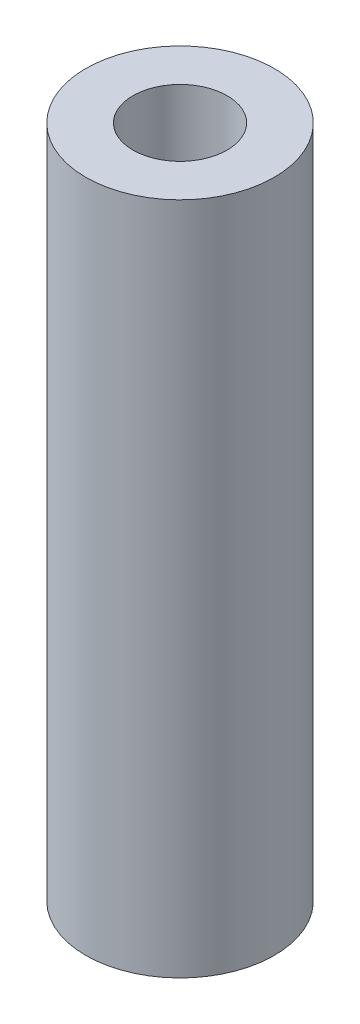
ISO-10303-21;
HEADER;
FILE_DESCRIPTION(('STEP AP214'),'2;1');
FILE_NAME('part.step','',(''),(''),'','','');
FILE_SCHEMA(('AUTOMOTIVE_DESIGN { 1 0 10303 214 1 1 1 1 }'));
ENDSEC;
DATA;
#1=APPLICATION_CONTEXT('core data for automotive mechanical design processes');
#2=APPLICATION_PROTOCOL_DEFINITION('international standard','automotive_design',2000,#1);
#3=PRODUCT_CONTEXT('',#1,'mechanical');
#4=PRODUCT('Part','Part','',(#3));
#5=PRODUCT_RELATED_PRODUCT_CATEGORY('part','',(#4));
#6=PRODUCT_DEFINITION_FORMATION('','',#4);
#7=PRODUCT_DEFINITION_CONTEXT('part definition',#1,'design');
#8=PRODUCT_DEFINITION('design','',#6,#7);
#9=PRODUCT_DEFINITION_SHAPE('','',#8);
#10=(LENGTH_UNIT() NAMED_UNIT(*) SI_UNIT(.MILLI.,.METRE.));
#11=(NAMED_UNIT(*) PLANE_ANGLE_UNIT() SI_UNIT($,.RADIAN.));
#12=(NAMED_UNIT(*) SI_UNIT($,.STERADIAN.) SOLID_ANGLE_UNIT());
#13=UNCERTAINTY_MEASURE_WITH_UNIT(LENGTH_MEASURE(1.E-05),#10,'distance_accuracy_value','');
#14=(GEOMETRIC_REPRESENTATION_CONTEXT(3) GLOBAL_UNCERTAINTY_ASSIGNED_CONTEXT((#13)) GLOBAL_UNIT_ASSIGNED_CONTEXT((#10,
#11,#12)) REPRESENTATION_CONTEXT('',''));
#15=CARTESIAN_POINT('',(0.,0.,0.));
#16=DIRECTION('',(0.,0.,1.));
#17=DIRECTION('',(1.,0.,0.));
#18=AXIS2_PLACEMENT_3D('',#15,#16,#17);
#19=CARTESIAN_POINT('',(0.,28.6,0.));
#20=DIRECTION('',(0.,1.,0.));
#21=DIRECTION('',(0.,0.,1.));
#22=AXIS2_PLACEMENT_3D('',#19,#20,#21);
#23=PLANE('',#22);
#24=CARTESIAN_POINT('',(0.,28.6,0.));
#25=DIRECTION('',(0.,1.,0.));
#26=DIRECTION('',(0.,0.,1.));
#27=AXIS2_PLACEMENT_3D('',#24,#25,#26);
#28=CIRCLE('',#27,4.);
#29=CARTESIAN_POINT('',(0.,28.6,4.));
#30=VERTEX_POINT('',#29);
#31=EDGE_CURVE('E10',#30,#30,#28,.T.);
#32=ORIENTED_EDGE('',*,*,#31,.T.);
#33=EDGE_LOOP('',(#32));
#34=FACE_BOUND('',#33,.T.);
#35=CARTESIAN_POINT('',(0.,28.6,0.));
#36=DIRECTION('',(0.,1.,0.));
#37=DIRECTION('',(0.,0.,1.));
#38=AXIS2_PLACEMENT_3D('',#35,#36,#37);
#39=CIRCLE('',#38,2.);
#40=CARTESIAN_POINT('',(0.,28.6,2.));
#41=VERTEX_POINT('',#40);
#42=EDGE_CURVE('E50',#41,#41,#39,.T.);
#43=ORIENTED_EDGE('',*,*,#42,.F.);
#44=EDGE_LOOP('',(#43));
#45=FACE_BOUND('',#44,.T.);
#46=ADVANCED_FACE('F37',(#34,#45),#23,.T.);
#47=CARTESIAN_POINT('',(0.,0.,0.));
#48=DIRECTION('',(0.,1.,0.));
#49=DIRECTION('',(0.,0.,1.));
#50=AXIS2_PLACEMENT_3D('',#47,#48,#49);
#51=PLANE('',#50);
#52=CARTESIAN_POINT('',(0.,0.,0.));
#53=DIRECTION('',(0.,1.,0.));
#54=DIRECTION('',(0.,0.,1.));
#55=AXIS2_PLACEMENT_3D('',#52,#53,#54);
#56=CIRCLE('',#55,4.);
#57=CARTESIAN_POINT('',(0.,0.,4.));
#58=VERTEX_POINT('',#57);
#59=EDGE_CURVE('E41',#58,#58,#56,.T.);
#60=ORIENTED_EDGE('',*,*,#59,.F.);
#61=EDGE_LOOP('',(#60));
#62=FACE_BOUND('',#61,.T.);
#63=CARTESIAN_POINT('',(0.,0.,0.));
#64=DIRECTION('',(0.,1.,0.));
#65=DIRECTION('',(0.,0.,1.));
#66=AXIS2_PLACEMENT_3D('',#63,#64,#65);
#67=CIRCLE('',#66,2.);
#68=CARTESIAN_POINT('',(0.,0.,2.));
#69=VERTEX_POINT('',#68);
#70=EDGE_CURVE('E52',#69,#69,#67,.T.);
#71=ORIENTED_EDGE('',*,*,#70,.T.);
#72=EDGE_LOOP('',(#71));
#73=FACE_BOUND('',#72,.T.);
#74=ADVANCED_FACE('F64',(#62,#73),#51,.F.);
#75=CARTESIAN_POINT('',(0.,28.6,0.));
#76=DIRECTION('',(0.,-1.,0.));
#77=DIRECTION('',(0.,0.,-1.));
#78=AXIS2_PLACEMENT_3D('',#75,#76,#77);
#79=CYLINDRICAL_SURFACE('',#78,4.);
#80=ORIENTED_EDGE('',*,*,#31,.F.);
#81=EDGE_LOOP('',(#80));
#82=FACE_BOUND('',#81,.T.);
#83=ORIENTED_EDGE('',*,*,#59,.T.);
#84=EDGE_LOOP('',(#83));
#85=FACE_BOUND('',#84,.T.);
#86=ADVANCED_FACE('F39',(#82,#85),#79,.T.);
#87=CARTESIAN_POINT('',(0.,28.6,0.));
#88=DIRECTION('',(0.,-1.,0.));
#89=DIRECTION('',(0.,0.,-1.));
#90=AXIS2_PLACEMENT_3D('',#87,#88,#89);
#91=CYLINDRICAL_SURFACE('',#90,2.);
#92=ORIENTED_EDGE('',*,*,#42,.T.);
#93=EDGE_LOOP('',(#92));
#94=FACE_BOUND('',#93,.T.);
#95=ORIENTED_EDGE('',*,*,#70,.F.);
#96=EDGE_LOOP('',(#95));
#97=FACE_BOUND('',#96,.T.);
#98=ADVANCED_FACE('F60',(#94,#97),#91,.F.);
#99=CLOSED_SHELL('',(#46,#74,#86,#98));
#100=MANIFOLD_SOLID_BREP('B2',#99);
#101=ADVANCED_BREP_SHAPE_REPRESENTATION('',(#18,#100),#14);
#102=SHAPE_DEFINITION_REPRESENTATION(#9,#101);
ENDSEC;
END-ISO-10303-21;
